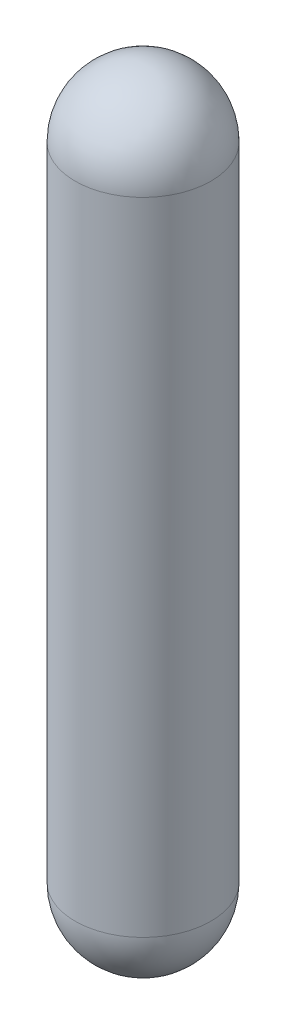
ISO-10303-21;
HEADER;
FILE_DESCRIPTION(('STEP AP214'),'2;1');
FILE_NAME('part.step','',(''),(''),'','','');
FILE_SCHEMA(('AUTOMOTIVE_DESIGN { 1 0 10303 214 1 1 1 1 }'));
ENDSEC;
DATA;
#1=APPLICATION_CONTEXT('core data for automotive mechanical design processes');
#2=APPLICATION_PROTOCOL_DEFINITION('international standard','automotive_design',2000,#1);
#3=PRODUCT_CONTEXT('',#1,'mechanical');
#4=PRODUCT('Part','Part','',(#3));
#5=PRODUCT_RELATED_PRODUCT_CATEGORY('part','',(#4));
#6=PRODUCT_DEFINITION_FORMATION('','',#4);
#7=PRODUCT_DEFINITION_CONTEXT('part definition',#1,'design');
#8=PRODUCT_DEFINITION('design','',#6,#7);
#9=PRODUCT_DEFINITION_SHAPE('','',#8);
#10=(LENGTH_UNIT() NAMED_UNIT(*) SI_UNIT(.MILLI.,.METRE.));
#11=(NAMED_UNIT(*) PLANE_ANGLE_UNIT() SI_UNIT($,.RADIAN.));
#12=(NAMED_UNIT(*) SI_UNIT($,.STERADIAN.) SOLID_ANGLE_UNIT());
#13=UNCERTAINTY_MEASURE_WITH_UNIT(LENGTH_MEASURE(1.E-05),#10,'distance_accuracy_value','');
#14=(GEOMETRIC_REPRESENTATION_CONTEXT(3) GLOBAL_UNCERTAINTY_ASSIGNED_CONTEXT((#13)) GLOBAL_UNIT_ASSIGNED_CONTEXT((#10,
#11,#12)) REPRESENTATION_CONTEXT('',''));
#15=CARTESIAN_POINT('',(0.,0.,0.));
#16=DIRECTION('',(0.,0.,1.));
#17=DIRECTION('',(1.,0.,0.));
#18=AXIS2_PLACEMENT_3D('',#15,#16,#17);
#19=CARTESIAN_POINT('',(0.,85.383567839196,0.));
#20=DIRECTION('',(0.,-1.,0.));
#21=DIRECTION('',(1.,0.,0.));
#22=AXIS2_PLACEMENT_3D('',#19,#20,#21);
#23=SPHERICAL_SURFACE('',#22,9.04826138219476);
#24=CARTESIAN_POINT('',(0.,85.383567839196,0.));
#25=DIRECTION('',(0.,-1.,0.));
#26=DIRECTION('',(0.,0.,-1.));
#27=AXIS2_PLACEMENT_3D('',#24,#25,#26);
#28=CIRCLE('',#27,9.04826138219476);
#29=CARTESIAN_POINT('',(0.,85.383567839196,-9.04826138219476));
#30=VERTEX_POINT('',#29);
#31=EDGE_CURVE('E37',#30,#30,#28,.T.);
#32=ORIENTED_EDGE('',*,*,#31,.F.);
#33=EDGE_LOOP('',(#32));
#34=FACE_BOUND('',#33,.T.);
#35=ADVANCED_FACE('F31',(#34),#23,.T.);
#36=CARTESIAN_POINT('',(0.,0.,0.));
#37=DIRECTION('',(0.,-1.,0.));
#38=DIRECTION('',(-1.,0.,0.));
#39=AXIS2_PLACEMENT_3D('',#36,#37,#38);
#40=SPHERICAL_SURFACE('',#39,9.04826138219476);
#41=CARTESIAN_POINT('',(0.,0.,0.));
#42=DIRECTION('',(0.,-1.,0.));
#43=DIRECTION('',(0.,0.,-1.));
#44=AXIS2_PLACEMENT_3D('',#41,#42,#43);
#45=CIRCLE('',#44,9.04826138219476);
#46=CARTESIAN_POINT('',(0.,0.,-9.04826138219476));
#47=VERTEX_POINT('',#46);
#48=EDGE_CURVE('E10',#47,#47,#45,.T.);
#49=ORIENTED_EDGE('',*,*,#48,.T.);
#50=EDGE_LOOP('',(#49));
#51=FACE_BOUND('',#50,.T.);
#52=ADVANCED_FACE('F47',(#51),#40,.T.);
#53=CARTESIAN_POINT('',(0.,0.,0.));
#54=DIRECTION('',(0.,-1.,0.));
#55=DIRECTION('',(0.,0.,-1.));
#56=AXIS2_PLACEMENT_3D('',#53,#54,#55);
#57=CYLINDRICAL_SURFACE('',#56,9.04826138219476);
#58=ORIENTED_EDGE('',*,*,#31,.T.);
#59=EDGE_LOOP('',(#58));
#60=FACE_BOUND('',#59,.T.);
#61=ORIENTED_EDGE('',*,*,#48,.F.);
#62=EDGE_LOOP('',(#61));
#63=FACE_BOUND('',#62,.T.);
#64=ADVANCED_FACE('F43',(#60,#63),#57,.T.);
#65=CLOSED_SHELL('',(#35,#52,#64));
#66=MANIFOLD_SOLID_BREP('B2',#65);
#67=ADVANCED_BREP_SHAPE_REPRESENTATION('',(#18,#66),#14);
#68=SHAPE_DEFINITION_REPRESENTATION(#9,#67);
ENDSEC;
END-ISO-10303-21;
